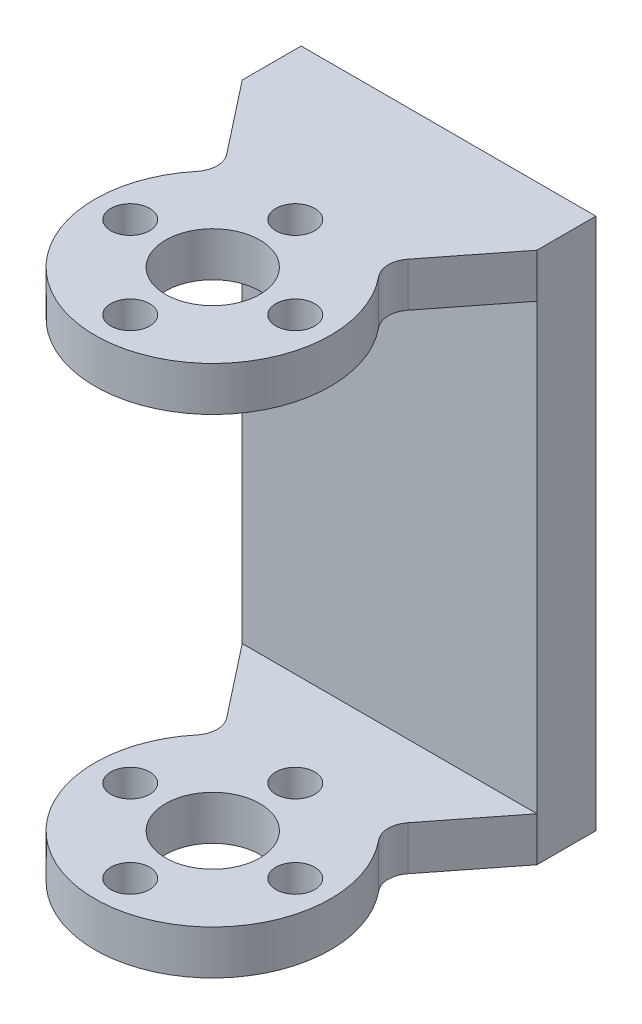
ISO-10303-21;
HEADER;
FILE_DESCRIPTION(('STEP AP214'),'2;1');
FILE_NAME('part.step','',(''),(''),'','','');
FILE_SCHEMA(('AUTOMOTIVE_DESIGN { 1 0 10303 214 1 1 1 1 }'));
ENDSEC;
DATA;
#1=APPLICATION_CONTEXT('core data for automotive mechanical design processes');
#2=APPLICATION_PROTOCOL_DEFINITION('international standard','automotive_design',2000,#1);
#3=PRODUCT_CONTEXT('',#1,'mechanical');
#4=PRODUCT('Part','Part','',(#3));
#5=PRODUCT_RELATED_PRODUCT_CATEGORY('part','',(#4));
#6=PRODUCT_DEFINITION_FORMATION('','',#4);
#7=PRODUCT_DEFINITION_CONTEXT('part definition',#1,'design');
#8=PRODUCT_DEFINITION('design','',#6,#7);
#9=PRODUCT_DEFINITION_SHAPE('','',#8);
#10=(LENGTH_UNIT() NAMED_UNIT(*) SI_UNIT(.MILLI.,.METRE.));
#11=(NAMED_UNIT(*) PLANE_ANGLE_UNIT() SI_UNIT($,.RADIAN.));
#12=(NAMED_UNIT(*) SI_UNIT($,.STERADIAN.) SOLID_ANGLE_UNIT());
#13=UNCERTAINTY_MEASURE_WITH_UNIT(LENGTH_MEASURE(1.E-05),#10,'distance_accuracy_value','');
#14=(GEOMETRIC_REPRESENTATION_CONTEXT(3) GLOBAL_UNCERTAINTY_ASSIGNED_CONTEXT((#13)) GLOBAL_UNIT_ASSIGNED_CONTEXT((#10,
#11,#12)) REPRESENTATION_CONTEXT('',''));
#15=CARTESIAN_POINT('',(0.,0.,0.));
#16=DIRECTION('',(0.,0.,1.));
#17=DIRECTION('',(1.,0.,0.));
#18=AXIS2_PLACEMENT_3D('',#15,#16,#17);
#19=CARTESIAN_POINT('',(-12.5,45.15,-15.));
#20=DIRECTION('',(0.786686892651801,0.,-0.617352195209391));
#21=DIRECTION('',(-0.617352195209391,0.,-0.786686892651801));
#22=AXIS2_PLACEMENT_3D('',#19,#20,#21);
#23=PLANE('',#22);
#24=DIRECTION('',(0.617352195209391,0.,0.786686892651801));
#25=VECTOR('',#24,1.);
#26=CARTESIAN_POINT('',(-12.5,0.,-15.));
#27=LINE('',#26,#25);
#28=CARTESIAN_POINT('',(-12.5,0.,-15.));
#29=VERTEX_POINT('',#28);
#30=CARTESIAN_POINT('',(-7.68689697173493,0.,-8.8667018685589));
#31=VERTEX_POINT('',#30);
#32=EDGE_CURVE('E230',#29,#31,#27,.T.);
#33=ORIENTED_EDGE('',*,*,#32,.T.);
#34=DIRECTION('',(0.,1.,0.));
#35=VECTOR('',#34,1.);
#36=CARTESIAN_POINT('',(-7.68689697173493,3.75,-8.8667018685589));
#37=LINE('',#36,#35);
#38=CARTESIAN_POINT('',(-7.68689697173493,3.75,-8.8667018685589));
#39=VERTEX_POINT('',#38);
#40=EDGE_CURVE('E58',#31,#39,#37,.T.);
#41=ORIENTED_EDGE('',*,*,#40,.T.);
#42=DIRECTION('',(-0.617352195209391,0.,-0.786686892651801));
#43=VECTOR('',#42,1.);
#44=CARTESIAN_POINT('',(-12.5,3.75,-15.));
#45=LINE('',#44,#43);
#46=CARTESIAN_POINT('',(-12.5,3.75,-15.));
#47=VERTEX_POINT('',#46);
#48=EDGE_CURVE('E197',#39,#47,#45,.T.);
#49=ORIENTED_EDGE('',*,*,#48,.T.);
#50=DIRECTION('',(0.,-1.,0.));
#51=VECTOR('',#50,1.);
#52=CARTESIAN_POINT('',(-12.5,45.15,-15.));
#53=LINE('',#52,#51);
#54=EDGE_CURVE('E234',#47,#29,#53,.T.);
#55=ORIENTED_EDGE('',*,*,#54,.T.);
#56=EDGE_LOOP('',(#33,#41,#49,#55));
#57=FACE_BOUND('',#56,.T.);
#58=ADVANCED_FACE('F39',(#57),#23,.F.);
#59=CARTESIAN_POINT('',(0.,45.15,0.));
#60=DIRECTION('',(0.,-1.,0.));
#61=DIRECTION('',(0.,0.,-1.));
#62=AXIS2_PLACEMENT_3D('',#59,#60,#61);
#63=CYLINDRICAL_SURFACE('',#62,10.);
#64=CARTESIAN_POINT('',(0.,0.,0.));
#65=DIRECTION('',(0.,1.,0.));
#66=DIRECTION('',(0.,0.,1.));
#67=AXIS2_PLACEMENT_3D('',#64,#65,#66);
#68=CIRCLE('',#67,10.);
#69=CARTESIAN_POINT('',(-7.71689229753211,0.,-6.35999789845009));
#70=VERTEX_POINT('',#69);
#71=CARTESIAN_POINT('',(7.71689229753211,0.,-6.35999789845009));
#72=VERTEX_POINT('',#71);
#73=EDGE_CURVE('E227',#70,#72,#68,.T.);
#74=ORIENTED_EDGE('',*,*,#73,.T.);
#75=DIRECTION('',(0.,-1.,0.));
#76=VECTOR('',#75,1.);
#77=CARTESIAN_POINT('',(7.71689229753211,45.15,-6.35999789845009));
#78=LINE('',#77,#76);
#79=CARTESIAN_POINT('',(7.71689229753211,3.75,-6.35999789845009));
#80=VERTEX_POINT('',#79);
#81=EDGE_CURVE('E277',#72,#80,#78,.F.);
#82=ORIENTED_EDGE('',*,*,#81,.T.);
#83=CARTESIAN_POINT('',(0.,3.75,0.));
#84=DIRECTION('',(0.,-1.,0.));
#85=DIRECTION('',(0.,0.,-1.));
#86=AXIS2_PLACEMENT_3D('',#83,#84,#85);
#87=CIRCLE('',#86,10.);
#88=CARTESIAN_POINT('',(-7.71689229753211,3.75,-6.35999789845009));
#89=VERTEX_POINT('',#88);
#90=EDGE_CURVE('E154',#80,#89,#87,.T.);
#91=ORIENTED_EDGE('',*,*,#90,.T.);
#92=DIRECTION('',(0.,-1.,0.));
#93=VECTOR('',#92,1.);
#94=CARTESIAN_POINT('',(-7.71689229753211,45.15,-6.35999789845009));
#95=LINE('',#94,#93);
#96=EDGE_CURVE('E274',#89,#70,#95,.T.);
#97=ORIENTED_EDGE('',*,*,#96,.T.);
#98=EDGE_LOOP('',(#74,#82,#91,#97));
#99=FACE_BOUND('',#98,.T.);
#100=ADVANCED_FACE('F321',(#99),#63,.T.);
#101=CARTESIAN_POINT('',(6.61437827766147,45.15,-7.5));
#102=DIRECTION('',(-0.786686892651801,0.,-0.617352195209391));
#103=DIRECTION('',(-0.617352195209391,0.,0.786686892651801));
#104=AXIS2_PLACEMENT_3D('',#101,#102,#103);
#105=PLANE('',#104);
#106=DIRECTION('',(-0.617352195209391,0.,0.786686892651801));
#107=VECTOR('',#106,1.);
#108=CARTESIAN_POINT('',(6.61437827766147,3.75,-7.5));
#109=LINE('',#108,#107);
#110=CARTESIAN_POINT('',(12.5,3.75,-15.));
#111=VERTEX_POINT('',#110);
#112=CARTESIAN_POINT('',(7.68689697173493,3.75,-8.8667018685589));
#113=VERTEX_POINT('',#112);
#114=EDGE_CURVE('E138',#111,#113,#109,.T.);
#115=ORIENTED_EDGE('',*,*,#114,.T.);
#116=DIRECTION('',(0.,1.,0.));
#117=VECTOR('',#116,1.);
#118=CARTESIAN_POINT('',(7.68689697173493,0.,-8.8667018685589));
#119=LINE('',#118,#117);
#120=CARTESIAN_POINT('',(7.68689697173493,0.,-8.8667018685589));
#121=VERTEX_POINT('',#120);
#122=EDGE_CURVE('E273',#113,#121,#119,.F.);
#123=ORIENTED_EDGE('',*,*,#122,.T.);
#124=DIRECTION('',(0.617352195209391,0.,-0.786686892651801));
#125=VECTOR('',#124,1.);
#126=CARTESIAN_POINT('',(6.61437827766147,0.,-7.5));
#127=LINE('',#126,#125);
#128=CARTESIAN_POINT('',(12.5,0.,-15.));
#129=VERTEX_POINT('',#128);
#130=EDGE_CURVE('E171',#121,#129,#127,.T.);
#131=ORIENTED_EDGE('',*,*,#130,.T.);
#132=DIRECTION('',(0.,-1.,0.));
#133=VECTOR('',#132,1.);
#134=CARTESIAN_POINT('',(12.5,45.15,-15.));
#135=LINE('',#134,#133);
#136=EDGE_CURVE('E170',#111,#129,#135,.T.);
#137=ORIENTED_EDGE('',*,*,#136,.F.);
#138=EDGE_LOOP('',(#115,#123,#131,#137));
#139=FACE_BOUND('',#138,.T.);
#140=ADVANCED_FACE('F168',(#139),#105,.F.);
#141=CARTESIAN_POINT('',(0.,45.15,0.));
#142=DIRECTION('',(0.,-1.,0.));
#143=DIRECTION('',(0.,0.,-1.));
#144=AXIS2_PLACEMENT_3D('',#141,#142,#143);
#145=CYLINDRICAL_SURFACE('',#144,4.);
#146=CARTESIAN_POINT('',(0.,3.75,0.));
#147=DIRECTION('',(0.,-1.,0.));
#148=DIRECTION('',(0.,0.,-1.));
#149=AXIS2_PLACEMENT_3D('',#146,#147,#148);
#150=CIRCLE('',#149,4.);
#151=CARTESIAN_POINT('',(0.,3.75,-4.));
#152=VERTEX_POINT('',#151);
#153=EDGE_CURVE('E151',#152,#152,#150,.T.);
#154=ORIENTED_EDGE('',*,*,#153,.F.);
#155=EDGE_LOOP('',(#154));
#156=FACE_BOUND('',#155,.T.);
#157=CARTESIAN_POINT('',(0.,0.,0.));
#158=DIRECTION('',(0.,1.,0.));
#159=DIRECTION('',(0.,0.,1.));
#160=AXIS2_PLACEMENT_3D('',#157,#158,#159);
#161=CIRCLE('',#160,4.);
#162=CARTESIAN_POINT('',(0.,0.,4.));
#163=VERTEX_POINT('',#162);
#164=EDGE_CURVE('E201',#163,#163,#161,.T.);
#165=ORIENTED_EDGE('',*,*,#164,.F.);
#166=EDGE_LOOP('',(#165));
#167=FACE_BOUND('',#166,.T.);
#168=ADVANCED_FACE('F368',(#156,#167),#145,.F.);
#169=CARTESIAN_POINT('',(0.,45.15,0.));
#170=DIRECTION('',(0.,1.,0.));
#171=DIRECTION('',(0.,0.,1.));
#172=AXIS2_PLACEMENT_3D('',#169,#170,#171);
#173=PLANE('',#172);
#174=CARTESIAN_POINT('',(7.,45.15,0.));
#175=DIRECTION('',(0.,1.,0.));
#176=DIRECTION('',(-1.,0.,0.));
#177=AXIS2_PLACEMENT_3D('',#174,#175,#176);
#178=CIRCLE('',#177,1.65);
#179=CARTESIAN_POINT('',(5.35,45.15,0.));
#180=VERTEX_POINT('',#179);
#181=EDGE_CURVE('E429',#180,#180,#178,.T.);
#182=ORIENTED_EDGE('',*,*,#181,.F.);
#183=EDGE_LOOP('',(#182));
#184=FACE_BOUND('',#183,.T.);
#185=CARTESIAN_POINT('',(0.,45.15,7.));
#186=DIRECTION('',(0.,1.,0.));
#187=DIRECTION('',(0.,0.,-1.));
#188=AXIS2_PLACEMENT_3D('',#185,#186,#187);
#189=CIRCLE('',#188,1.65);
#190=CARTESIAN_POINT('',(0.,45.15,5.35));
#191=VERTEX_POINT('',#190);
#192=EDGE_CURVE('E469',#191,#191,#189,.T.);
#193=ORIENTED_EDGE('',*,*,#192,.F.);
#194=EDGE_LOOP('',(#193));
#195=FACE_BOUND('',#194,.T.);
#196=CARTESIAN_POINT('',(-7.,45.15,0.));
#197=DIRECTION('',(0.,1.,0.));
#198=DIRECTION('',(1.,0.,0.));
#199=AXIS2_PLACEMENT_3D('',#196,#197,#198);
#200=CIRCLE('',#199,1.65);
#201=CARTESIAN_POINT('',(-5.35,45.15,0.));
#202=VERTEX_POINT('',#201);
#203=EDGE_CURVE('E458',#202,#202,#200,.T.);
#204=ORIENTED_EDGE('',*,*,#203,.F.);
#205=EDGE_LOOP('',(#204));
#206=FACE_BOUND('',#205,.T.);
#207=CARTESIAN_POINT('',(0.,45.15,-7.));
#208=DIRECTION('',(0.,1.,0.));
#209=DIRECTION('',(0.,0.,1.));
#210=AXIS2_PLACEMENT_3D('',#207,#208,#209);
#211=CIRCLE('',#210,1.65);
#212=CARTESIAN_POINT('',(0.,45.15,-5.35));
#213=VERTEX_POINT('',#212);
#214=EDGE_CURVE('E448',#213,#213,#211,.T.);
#215=ORIENTED_EDGE('',*,*,#214,.F.);
#216=EDGE_LOOP('',(#215));
#217=FACE_BOUND('',#216,.T.);
#218=DIRECTION('',(0.,0.,-1.));
#219=VECTOR('',#218,1.);
#220=CARTESIAN_POINT('',(12.5,45.15,-15.));
#221=LINE('',#220,#219);
#222=CARTESIAN_POINT('',(12.5,45.15,-15.));
#223=VERTEX_POINT('',#222);
#224=CARTESIAN_POINT('',(12.5,45.15,-20.));
#225=VERTEX_POINT('',#224);
#226=EDGE_CURVE('E209',#223,#225,#221,.T.);
#227=ORIENTED_EDGE('',*,*,#226,.T.);
#228=DIRECTION('',(-1.,0.,0.));
#229=VECTOR('',#228,1.);
#230=CARTESIAN_POINT('',(-12.5,45.15,-20.));
#231=LINE('',#230,#229);
#232=CARTESIAN_POINT('',(-12.5,45.15,-20.));
#233=VERTEX_POINT('',#232);
#234=EDGE_CURVE('E214',#225,#233,#231,.T.);
#235=ORIENTED_EDGE('',*,*,#234,.T.);
#236=DIRECTION('',(0.,0.,1.));
#237=VECTOR('',#236,1.);
#238=CARTESIAN_POINT('',(-12.5,45.15,-15.));
#239=LINE('',#238,#237);
#240=CARTESIAN_POINT('',(-12.5,45.15,-15.));
#241=VERTEX_POINT('',#240);
#242=EDGE_CURVE('E215',#233,#241,#239,.T.);
#243=ORIENTED_EDGE('',*,*,#242,.T.);
#244=DIRECTION('',(0.617352195209391,0.,0.786686892651801));
#245=VECTOR('',#244,1.);
#246=CARTESIAN_POINT('',(-12.5,45.15,-15.));
#247=LINE('',#246,#245);
#248=CARTESIAN_POINT('',(-7.68689697173493,45.15,-8.8667018685589));
#249=VERTEX_POINT('',#248);
#250=EDGE_CURVE('E212',#241,#249,#247,.T.);
#251=ORIENTED_EDGE('',*,*,#250,.T.);
#252=CARTESIAN_POINT('',(-9.26027075703853,45.15,-7.63199747814011));
#253=DIRECTION('',(0.,1.,0.));
#254=DIRECTION('',(0.,0.,1.));
#255=AXIS2_PLACEMENT_3D('',#252,#253,#254);
#256=CIRCLE('',#255,2.);
#257=CARTESIAN_POINT('',(-7.71689229753211,45.15,-6.35999789845009));
#258=VERTEX_POINT('',#257);
#259=EDGE_CURVE('E291',#249,#258,#256,.F.);
#260=ORIENTED_EDGE('',*,*,#259,.T.);
#261=CARTESIAN_POINT('',(0.,45.15,0.));
#262=DIRECTION('',(0.,1.,0.));
#263=DIRECTION('',(0.,0.,1.));
#264=AXIS2_PLACEMENT_3D('',#261,#262,#263);
#265=CIRCLE('',#264,10.);
#266=CARTESIAN_POINT('',(7.71689229753211,45.15,-6.35999789845009));
#267=VERTEX_POINT('',#266);
#268=EDGE_CURVE('E220',#258,#267,#265,.T.);
#269=ORIENTED_EDGE('',*,*,#268,.T.);
#270=CARTESIAN_POINT('',(9.26027075703853,45.15,-7.63199747814011));
#271=DIRECTION('',(0.,1.,0.));
#272=DIRECTION('',(0.,0.,1.));
#273=AXIS2_PLACEMENT_3D('',#270,#271,#272);
#274=CIRCLE('',#273,2.);
#275=CARTESIAN_POINT('',(7.68689697173493,45.15,-8.8667018685589));
#276=VERTEX_POINT('',#275);
#277=EDGE_CURVE('E283',#267,#276,#274,.F.);
#278=ORIENTED_EDGE('',*,*,#277,.T.);
#279=DIRECTION('',(0.617352195209391,0.,-0.786686892651801));
#280=VECTOR('',#279,1.);
#281=CARTESIAN_POINT('',(6.61437827766147,45.15,-7.5));
#282=LINE('',#281,#280);
#283=EDGE_CURVE('E179',#276,#223,#282,.T.);
#284=ORIENTED_EDGE('',*,*,#283,.T.);
#285=EDGE_LOOP('',(#227,#235,#243,#251,#260,#269,#278,#284));
#286=FACE_BOUND('',#285,.T.);
#287=CARTESIAN_POINT('',(0.,45.15,0.));
#288=DIRECTION('',(0.,1.,0.));
#289=DIRECTION('',(0.,0.,1.));
#290=AXIS2_PLACEMENT_3D('',#287,#288,#289);
#291=CIRCLE('',#290,4.);
#292=CARTESIAN_POINT('',(0.,45.15,4.));
#293=VERTEX_POINT('',#292);
#294=EDGE_CURVE('E205',#293,#293,#291,.T.);
#295=ORIENTED_EDGE('',*,*,#294,.F.);
#296=EDGE_LOOP('',(#295));
#297=FACE_BOUND('',#296,.T.);
#298=ADVANCED_FACE('F296',(#184,#195,#206,#217,#286,#297),#173,.T.);
#299=CARTESIAN_POINT('',(0.,0.,0.));
#300=DIRECTION('',(0.,1.,0.));
#301=DIRECTION('',(0.,0.,1.));
#302=AXIS2_PLACEMENT_3D('',#299,#300,#301);
#303=PLANE('',#302);
#304=CARTESIAN_POINT('',(7.,0.,0.));
#305=DIRECTION('',(0.,1.,0.));
#306=DIRECTION('',(-1.,0.,0.));
#307=AXIS2_PLACEMENT_3D('',#304,#305,#306);
#308=CIRCLE('',#307,1.65);
#309=CARTESIAN_POINT('',(5.35,0.,0.));
#310=VERTEX_POINT('',#309);
#311=EDGE_CURVE('E257',#310,#310,#308,.T.);
#312=ORIENTED_EDGE('',*,*,#311,.T.);
#313=EDGE_LOOP('',(#312));
#314=FACE_BOUND('',#313,.T.);
#315=CARTESIAN_POINT('',(0.,0.,7.));
#316=DIRECTION('',(0.,1.,0.));
#317=DIRECTION('',(0.,0.,-1.));
#318=AXIS2_PLACEMENT_3D('',#315,#316,#317);
#319=CIRCLE('',#318,1.65);
#320=CARTESIAN_POINT('',(0.,0.,5.35));
#321=VERTEX_POINT('',#320);
#322=EDGE_CURVE('E468',#321,#321,#319,.T.);
#323=ORIENTED_EDGE('',*,*,#322,.T.);
#324=EDGE_LOOP('',(#323));
#325=FACE_BOUND('',#324,.T.);
#326=CARTESIAN_POINT('',(-7.,0.,0.));
#327=DIRECTION('',(0.,1.,0.));
#328=DIRECTION('',(1.,0.,0.));
#329=AXIS2_PLACEMENT_3D('',#326,#327,#328);
#330=CIRCLE('',#329,1.65);
#331=CARTESIAN_POINT('',(-5.35,0.,0.));
#332=VERTEX_POINT('',#331);
#333=EDGE_CURVE('E465',#332,#332,#330,.T.);
#334=ORIENTED_EDGE('',*,*,#333,.T.);
#335=EDGE_LOOP('',(#334));
#336=FACE_BOUND('',#335,.T.);
#337=CARTESIAN_POINT('',(0.,0.,-7.));
#338=DIRECTION('',(0.,1.,0.));
#339=DIRECTION('',(0.,0.,1.));
#340=AXIS2_PLACEMENT_3D('',#337,#338,#339);
#341=CIRCLE('',#340,1.65);
#342=CARTESIAN_POINT('',(0.,0.,-5.35));
#343=VERTEX_POINT('',#342);
#344=EDGE_CURVE('E251',#343,#343,#341,.T.);
#345=ORIENTED_EDGE('',*,*,#344,.T.);
#346=EDGE_LOOP('',(#345));
#347=FACE_BOUND('',#346,.T.);
#348=DIRECTION('',(0.,0.,-1.));
#349=VECTOR('',#348,1.);
#350=CARTESIAN_POINT('',(12.5,0.,-15.));
#351=LINE('',#350,#349);
#352=CARTESIAN_POINT('',(12.5,0.,-20.));
#353=VERTEX_POINT('',#352);
#354=EDGE_CURVE('E204',#129,#353,#351,.T.);
#355=ORIENTED_EDGE('',*,*,#354,.F.);
#356=ORIENTED_EDGE('',*,*,#130,.F.);
#357=CARTESIAN_POINT('',(9.26027075703853,0.,-7.63199747814011));
#358=DIRECTION('',(0.,1.,0.));
#359=DIRECTION('',(0.,0.,1.));
#360=AXIS2_PLACEMENT_3D('',#357,#358,#359);
#361=CIRCLE('',#360,2.);
#362=EDGE_CURVE('E286',#121,#72,#361,.T.);
#363=ORIENTED_EDGE('',*,*,#362,.T.);
#364=ORIENTED_EDGE('',*,*,#73,.F.);
#365=CARTESIAN_POINT('',(-9.26027075703853,0.,-7.63199747814011));
#366=DIRECTION('',(0.,1.,0.));
#367=DIRECTION('',(0.,0.,1.));
#368=AXIS2_PLACEMENT_3D('',#365,#366,#367);
#369=CIRCLE('',#368,2.);
#370=EDGE_CURVE('E50',#70,#31,#369,.T.);
#371=ORIENTED_EDGE('',*,*,#370,.T.);
#372=ORIENTED_EDGE('',*,*,#32,.F.);
#373=DIRECTION('',(0.,0.,1.));
#374=VECTOR('',#373,1.);
#375=CARTESIAN_POINT('',(-12.5,0.,-15.));
#376=LINE('',#375,#374);
#377=CARTESIAN_POINT('',(-12.5,0.,-20.));
#378=VERTEX_POINT('',#377);
#379=EDGE_CURVE('E225',#378,#29,#376,.T.);
#380=ORIENTED_EDGE('',*,*,#379,.F.);
#381=DIRECTION('',(-1.,0.,0.));
#382=VECTOR('',#381,1.);
#383=CARTESIAN_POINT('',(-12.5,0.,-20.));
#384=LINE('',#383,#382);
#385=EDGE_CURVE('E224',#353,#378,#384,.T.);
#386=ORIENTED_EDGE('',*,*,#385,.F.);
#387=EDGE_LOOP('',(#355,#356,#363,#364,#371,#372,#380,#386));
#388=FACE_BOUND('',#387,.T.);
#389=ORIENTED_EDGE('',*,*,#164,.T.);
#390=EDGE_LOOP('',(#389));
#391=FACE_BOUND('',#390,.T.);
#392=ADVANCED_FACE('F324',(#314,#325,#336,#347,#388,#391),#303,.F.);
#393=CARTESIAN_POINT('',(12.5,45.15,-15.));
#394=DIRECTION('',(-1.,0.,0.));
#395=DIRECTION('',(0.,0.,1.));
#396=AXIS2_PLACEMENT_3D('',#393,#394,#395);
#397=PLANE('',#396);
#398=ORIENTED_EDGE('',*,*,#354,.T.);
#399=DIRECTION('',(0.,-1.,0.));
#400=VECTOR('',#399,1.);
#401=CARTESIAN_POINT('',(12.5,45.15,-20.));
#402=LINE('',#401,#400);
#403=EDGE_CURVE('E244',#225,#353,#402,.T.);
#404=ORIENTED_EDGE('',*,*,#403,.F.);
#405=ORIENTED_EDGE('',*,*,#226,.F.);
#406=CARTESIAN_POINT('',(12.5,41.4,-15.));
#407=VERTEX_POINT('',#406);
#408=EDGE_CURVE('E175',#223,#407,#135,.T.);
#409=ORIENTED_EDGE('',*,*,#408,.T.);
#410=DIRECTION('',(0.,-1.,0.));
#411=VECTOR('',#410,1.);
#412=CARTESIAN_POINT('',(12.5,3.75,-15.));
#413=LINE('',#412,#411);
#414=EDGE_CURVE('E159',#407,#111,#413,.T.);
#415=ORIENTED_EDGE('',*,*,#414,.T.);
#416=ORIENTED_EDGE('',*,*,#136,.T.);
#417=EDGE_LOOP('',(#398,#404,#405,#409,#415,#416));
#418=FACE_BOUND('',#417,.T.);
#419=ADVANCED_FACE('F178',(#418),#397,.F.);
#420=CARTESIAN_POINT('',(-12.5,45.15,-20.));
#421=DIRECTION('',(0.,0.,1.));
#422=DIRECTION('',(1.,0.,0.));
#423=AXIS2_PLACEMENT_3D('',#420,#421,#422);
#424=PLANE('',#423);
#425=ORIENTED_EDGE('',*,*,#385,.T.);
#426=DIRECTION('',(0.,-1.,0.));
#427=VECTOR('',#426,1.);
#428=CARTESIAN_POINT('',(-12.5,45.15,-20.));
#429=LINE('',#428,#427);
#430=EDGE_CURVE('E240',#233,#378,#429,.T.);
#431=ORIENTED_EDGE('',*,*,#430,.F.);
#432=ORIENTED_EDGE('',*,*,#234,.F.);
#433=ORIENTED_EDGE('',*,*,#403,.T.);
#434=EDGE_LOOP('',(#425,#431,#432,#433));
#435=FACE_BOUND('',#434,.T.);
#436=ADVANCED_FACE('F355',(#435),#424,.F.);
#437=CARTESIAN_POINT('',(-12.5,45.15,-15.));
#438=DIRECTION('',(1.,0.,0.));
#439=DIRECTION('',(0.,0.,-1.));
#440=AXIS2_PLACEMENT_3D('',#437,#438,#439);
#441=PLANE('',#440);
#442=ORIENTED_EDGE('',*,*,#379,.T.);
#443=ORIENTED_EDGE('',*,*,#54,.F.);
#444=DIRECTION('',(0.,-1.,0.));
#445=VECTOR('',#444,1.);
#446=CARTESIAN_POINT('',(-12.5,3.75,-15.));
#447=LINE('',#446,#445);
#448=CARTESIAN_POINT('',(-12.5,41.4,-15.));
#449=VERTEX_POINT('',#448);
#450=EDGE_CURVE('E161',#449,#47,#447,.T.);
#451=ORIENTED_EDGE('',*,*,#450,.F.);
#452=EDGE_CURVE('E233',#241,#449,#53,.T.);
#453=ORIENTED_EDGE('',*,*,#452,.F.);
#454=ORIENTED_EDGE('',*,*,#242,.F.);
#455=ORIENTED_EDGE('',*,*,#430,.T.);
#456=EDGE_LOOP('',(#442,#443,#451,#453,#454,#455));
#457=FACE_BOUND('',#456,.T.);
#458=ADVANCED_FACE('F312',(#457),#441,.F.);
#459=DIRECTION('',(0.617352195209391,0.,0.786686892651801));
#460=VECTOR('',#459,1.);
#461=CARTESIAN_POINT('',(-12.5,41.4,-15.));
#462=LINE('',#461,#460);
#463=CARTESIAN_POINT('',(-7.68689697173493,41.4,-8.8667018685589));
#464=VERTEX_POINT('',#463);
#465=EDGE_CURVE('E192',#449,#464,#462,.T.);
#466=ORIENTED_EDGE('',*,*,#465,.T.);
#467=DIRECTION('',(0.,1.,0.));
#468=VECTOR('',#467,1.);
#469=CARTESIAN_POINT('',(-7.68689697173493,45.15,-8.8667018685589));
#470=LINE('',#469,#468);
#471=EDGE_CURVE('E279',#464,#249,#470,.T.);
#472=ORIENTED_EDGE('',*,*,#471,.T.);
#473=ORIENTED_EDGE('',*,*,#250,.F.);
#474=ORIENTED_EDGE('',*,*,#452,.T.);
#475=EDGE_LOOP('',(#466,#472,#473,#474));
#476=FACE_BOUND('',#475,.T.);
#477=ADVANCED_FACE('F314',(#476),#23,.F.);
#478=CARTESIAN_POINT('',(0.,41.4,0.));
#479=DIRECTION('',(0.,1.,0.));
#480=DIRECTION('',(0.,0.,1.));
#481=AXIS2_PLACEMENT_3D('',#478,#479,#480);
#482=CIRCLE('',#481,10.);
#483=CARTESIAN_POINT('',(-7.71689229753211,41.4,-6.35999789845009));
#484=VERTEX_POINT('',#483);
#485=CARTESIAN_POINT('',(7.71689229753211,41.4,-6.35999789845009));
#486=VERTEX_POINT('',#485);
#487=EDGE_CURVE('E191',#484,#486,#482,.T.);
#488=ORIENTED_EDGE('',*,*,#487,.T.);
#489=DIRECTION('',(0.,-1.,0.));
#490=VECTOR('',#489,1.);
#491=CARTESIAN_POINT('',(7.71689229753211,45.15,-6.35999789845009));
#492=LINE('',#491,#490);
#493=EDGE_CURVE('E271',#486,#267,#492,.F.);
#494=ORIENTED_EDGE('',*,*,#493,.T.);
#495=ORIENTED_EDGE('',*,*,#268,.F.);
#496=DIRECTION('',(0.,-1.,0.));
#497=VECTOR('',#496,1.);
#498=CARTESIAN_POINT('',(-7.71689229753211,45.15,-6.35999789845009));
#499=LINE('',#498,#497);
#500=EDGE_CURVE('E268',#258,#484,#499,.T.);
#501=ORIENTED_EDGE('',*,*,#500,.T.);
#502=EDGE_LOOP('',(#488,#494,#495,#501));
#503=FACE_BOUND('',#502,.T.);
#504=ADVANCED_FACE('F303',(#503),#63,.T.);
#505=ORIENTED_EDGE('',*,*,#283,.F.);
#506=DIRECTION('',(0.,1.,0.));
#507=VECTOR('',#506,1.);
#508=CARTESIAN_POINT('',(7.68689697173493,41.4,-8.8667018685589));
#509=LINE('',#508,#507);
#510=CARTESIAN_POINT('',(7.68689697173493,41.4,-8.8667018685589));
#511=VERTEX_POINT('',#510);
#512=EDGE_CURVE('E243',#276,#511,#509,.F.);
#513=ORIENTED_EDGE('',*,*,#512,.T.);
#514=DIRECTION('',(0.617352195209391,0.,-0.786686892651801));
#515=VECTOR('',#514,1.);
#516=CARTESIAN_POINT('',(6.61437827766147,41.4,-7.5));
#517=LINE('',#516,#515);
#518=EDGE_CURVE('E189',#511,#407,#517,.T.);
#519=ORIENTED_EDGE('',*,*,#518,.T.);
#520=ORIENTED_EDGE('',*,*,#408,.F.);
#521=EDGE_LOOP('',(#505,#513,#519,#520));
#522=FACE_BOUND('',#521,.T.);
#523=ADVANCED_FACE('F349',(#522),#105,.F.);
#524=CARTESIAN_POINT('',(0.,41.4,0.));
#525=DIRECTION('',(0.,1.,0.));
#526=DIRECTION('',(0.,0.,1.));
#527=AXIS2_PLACEMENT_3D('',#524,#525,#526);
#528=CIRCLE('',#527,4.);
#529=CARTESIAN_POINT('',(0.,41.4,4.));
#530=VERTEX_POINT('',#529);
#531=EDGE_CURVE('E163',#530,#530,#528,.T.);
#532=ORIENTED_EDGE('',*,*,#531,.F.);
#533=EDGE_LOOP('',(#532));
#534=FACE_BOUND('',#533,.T.);
#535=ORIENTED_EDGE('',*,*,#294,.T.);
#536=EDGE_LOOP('',(#535));
#537=FACE_BOUND('',#536,.T.);
#538=ADVANCED_FACE('F376',(#534,#537),#145,.F.);
#539=CARTESIAN_POINT('',(12.5,3.75,25.));
#540=DIRECTION('',(0.,-1.,0.));
#541=DIRECTION('',(0.,0.,-1.));
#542=AXIS2_PLACEMENT_3D('',#539,#540,#541);
#543=PLANE('',#542);
#544=CARTESIAN_POINT('',(7.,3.75,0.));
#545=DIRECTION('',(0.,-1.,0.));
#546=DIRECTION('',(0.,0.,-1.));
#547=AXIS2_PLACEMENT_3D('',#544,#545,#546);
#548=CIRCLE('',#547,1.65);
#549=CARTESIAN_POINT('',(7.,3.75,-1.64999999999998));
#550=VERTEX_POINT('',#549);
#551=EDGE_CURVE('E262',#550,#550,#548,.T.);
#552=ORIENTED_EDGE('',*,*,#551,.T.);
#553=EDGE_LOOP('',(#552));
#554=FACE_BOUND('',#553,.T.);
#555=CARTESIAN_POINT('',(0.,3.75,7.));
#556=DIRECTION('',(0.,-1.,0.));
#557=DIRECTION('',(0.,0.,-1.));
#558=AXIS2_PLACEMENT_3D('',#555,#556,#557);
#559=CIRCLE('',#558,1.65);
#560=CARTESIAN_POINT('',(0.,3.75,5.35));
#561=VERTEX_POINT('',#560);
#562=EDGE_CURVE('E263',#561,#561,#559,.T.);
#563=ORIENTED_EDGE('',*,*,#562,.T.);
#564=EDGE_LOOP('',(#563));
#565=FACE_BOUND('',#564,.T.);
#566=CARTESIAN_POINT('',(-7.,3.75,0.));
#567=DIRECTION('',(0.,-1.,0.));
#568=DIRECTION('',(0.,0.,-1.));
#569=AXIS2_PLACEMENT_3D('',#566,#567,#568);
#570=CIRCLE('',#569,1.65);
#571=CARTESIAN_POINT('',(-7.,3.75,-1.65000000000007));
#572=VERTEX_POINT('',#571);
#573=EDGE_CURVE('E258',#572,#572,#570,.T.);
#574=ORIENTED_EDGE('',*,*,#573,.T.);
#575=EDGE_LOOP('',(#574));
#576=FACE_BOUND('',#575,.T.);
#577=CARTESIAN_POINT('',(0.,3.75,-7.));
#578=DIRECTION('',(0.,-1.,0.));
#579=DIRECTION('',(0.,0.,-1.));
#580=AXIS2_PLACEMENT_3D('',#577,#578,#579);
#581=CIRCLE('',#580,1.65);
#582=CARTESIAN_POINT('',(0.,3.75,-8.65));
#583=VERTEX_POINT('',#582);
#584=EDGE_CURVE('E185',#583,#583,#581,.T.);
#585=ORIENTED_EDGE('',*,*,#584,.T.);
#586=EDGE_LOOP('',(#585));
#587=FACE_BOUND('',#586,.T.);
#588=ORIENTED_EDGE('',*,*,#153,.T.);
#589=EDGE_LOOP('',(#588));
#590=FACE_BOUND('',#589,.T.);
#591=ORIENTED_EDGE('',*,*,#90,.F.);
#592=CARTESIAN_POINT('',(9.26027075703853,3.75,-7.63199747814011));
#593=DIRECTION('',(0.,-1.,0.));
#594=DIRECTION('',(0.,0.,-1.));
#595=AXIS2_PLACEMENT_3D('',#592,#593,#594);
#596=CIRCLE('',#595,2.);
#597=EDGE_CURVE('E146',#80,#113,#596,.T.);
#598=ORIENTED_EDGE('',*,*,#597,.T.);
#599=ORIENTED_EDGE('',*,*,#114,.F.);
#600=DIRECTION('',(-1.,0.,0.));
#601=VECTOR('',#600,1.);
#602=CARTESIAN_POINT('',(12.5,3.75,-15.));
#603=LINE('',#602,#601);
#604=EDGE_CURVE('E145',#111,#47,#603,.T.);
#605=ORIENTED_EDGE('',*,*,#604,.T.);
#606=ORIENTED_EDGE('',*,*,#48,.F.);
#607=CARTESIAN_POINT('',(-9.26027075703853,3.75,-7.63199747814011));
#608=DIRECTION('',(0.,-1.,0.));
#609=DIRECTION('',(0.,0.,-1.));
#610=AXIS2_PLACEMENT_3D('',#607,#608,#609);
#611=CIRCLE('',#610,2.);
#612=EDGE_CURVE('E11',#39,#89,#611,.T.);
#613=ORIENTED_EDGE('',*,*,#612,.T.);
#614=EDGE_LOOP('',(#591,#598,#599,#605,#606,#613));
#615=FACE_BOUND('',#614,.T.);
#616=ADVANCED_FACE('F141',(#554,#565,#576,#587,#590,#615),#543,.F.);
#617=CARTESIAN_POINT('',(12.5,41.4,25.));
#618=DIRECTION('',(0.,1.,0.));
#619=DIRECTION('',(0.,0.,1.));
#620=AXIS2_PLACEMENT_3D('',#617,#618,#619);
#621=PLANE('',#620);
#622=CARTESIAN_POINT('',(7.,41.4,0.));
#623=DIRECTION('',(0.,1.,0.));
#624=DIRECTION('',(0.,0.,1.));
#625=AXIS2_PLACEMENT_3D('',#622,#623,#624);
#626=CIRCLE('',#625,1.65);
#627=CARTESIAN_POINT('',(7.,41.4,1.65000000000002));
#628=VERTEX_POINT('',#627);
#629=EDGE_CURVE('E265',#628,#628,#626,.T.);
#630=ORIENTED_EDGE('',*,*,#629,.T.);
#631=EDGE_LOOP('',(#630));
#632=FACE_BOUND('',#631,.T.);
#633=CARTESIAN_POINT('',(0.,41.4,7.));
#634=DIRECTION('',(0.,1.,0.));
#635=DIRECTION('',(0.,0.,1.));
#636=AXIS2_PLACEMENT_3D('',#633,#634,#635);
#637=CIRCLE('',#636,1.65);
#638=CARTESIAN_POINT('',(0.,41.4,8.65));
#639=VERTEX_POINT('',#638);
#640=EDGE_CURVE('E256',#639,#639,#637,.T.);
#641=ORIENTED_EDGE('',*,*,#640,.T.);
#642=EDGE_LOOP('',(#641));
#643=FACE_BOUND('',#642,.T.);
#644=CARTESIAN_POINT('',(-7.,41.4,0.));
#645=DIRECTION('',(0.,1.,0.));
#646=DIRECTION('',(0.,0.,1.));
#647=AXIS2_PLACEMENT_3D('',#644,#645,#646);
#648=CIRCLE('',#647,1.65);
#649=CARTESIAN_POINT('',(-7.,41.4,1.64999999999993));
#650=VERTEX_POINT('',#649);
#651=EDGE_CURVE('E255',#650,#650,#648,.T.);
#652=ORIENTED_EDGE('',*,*,#651,.T.);
#653=EDGE_LOOP('',(#652));
#654=FACE_BOUND('',#653,.T.);
#655=CARTESIAN_POINT('',(0.,41.4,-7.));
#656=DIRECTION('',(0.,1.,0.));
#657=DIRECTION('',(0.,0.,1.));
#658=AXIS2_PLACEMENT_3D('',#655,#656,#657);
#659=CIRCLE('',#658,1.65);
#660=CARTESIAN_POINT('',(0.,41.4,-5.35));
#661=VERTEX_POINT('',#660);
#662=EDGE_CURVE('E248',#661,#661,#659,.T.);
#663=ORIENTED_EDGE('',*,*,#662,.T.);
#664=EDGE_LOOP('',(#663));
#665=FACE_BOUND('',#664,.T.);
#666=ORIENTED_EDGE('',*,*,#531,.T.);
#667=EDGE_LOOP('',(#666));
#668=FACE_BOUND('',#667,.T.);
#669=DIRECTION('',(-1.,0.,0.));
#670=VECTOR('',#669,1.);
#671=CARTESIAN_POINT('',(12.5,41.4,-15.));
#672=LINE('',#671,#670);
#673=EDGE_CURVE('E162',#407,#449,#672,.T.);
#674=ORIENTED_EDGE('',*,*,#673,.F.);
#675=ORIENTED_EDGE('',*,*,#518,.F.);
#676=CARTESIAN_POINT('',(9.26027075703853,41.4,-7.63199747814011));
#677=DIRECTION('',(0.,1.,0.));
#678=DIRECTION('',(0.,0.,1.));
#679=AXIS2_PLACEMENT_3D('',#676,#677,#678);
#680=CIRCLE('',#679,2.);
#681=EDGE_CURVE('E284',#511,#486,#680,.T.);
#682=ORIENTED_EDGE('',*,*,#681,.T.);
#683=ORIENTED_EDGE('',*,*,#487,.F.);
#684=CARTESIAN_POINT('',(-9.26027075703853,41.4,-7.63199747814011));
#685=DIRECTION('',(0.,1.,0.));
#686=DIRECTION('',(0.,0.,1.));
#687=AXIS2_PLACEMENT_3D('',#684,#685,#686);
#688=CIRCLE('',#687,2.);
#689=EDGE_CURVE('E287',#484,#464,#688,.T.);
#690=ORIENTED_EDGE('',*,*,#689,.T.);
#691=ORIENTED_EDGE('',*,*,#465,.F.);
#692=EDGE_LOOP('',(#674,#675,#682,#683,#690,#691));
#693=FACE_BOUND('',#692,.T.);
#694=ADVANCED_FACE('F309',(#632,#643,#654,#665,#668,#693),#621,.F.);
#695=CARTESIAN_POINT('',(12.5,3.75,-15.));
#696=DIRECTION('',(0.,0.,-1.));
#697=DIRECTION('',(-1.,0.,0.));
#698=AXIS2_PLACEMENT_3D('',#695,#696,#697);
#699=PLANE('',#698);
#700=ORIENTED_EDGE('',*,*,#450,.T.);
#701=ORIENTED_EDGE('',*,*,#604,.F.);
#702=ORIENTED_EDGE('',*,*,#414,.F.);
#703=ORIENTED_EDGE('',*,*,#673,.T.);
#704=EDGE_LOOP('',(#700,#701,#702,#703));
#705=FACE_BOUND('',#704,.T.);
#706=ADVANCED_FACE('F157',(#705),#699,.F.);
#707=CARTESIAN_POINT('',(0.,0.,-7.));
#708=DIRECTION('',(0.,1.,0.));
#709=DIRECTION('',(0.,0.,1.));
#710=AXIS2_PLACEMENT_3D('',#707,#708,#709);
#711=CYLINDRICAL_SURFACE('',#710,1.65);
#712=ORIENTED_EDGE('',*,*,#214,.T.);
#713=EDGE_LOOP('',(#712));
#714=FACE_BOUND('',#713,.T.);
#715=ORIENTED_EDGE('',*,*,#662,.F.);
#716=EDGE_LOOP('',(#715));
#717=FACE_BOUND('',#716,.T.);
#718=ADVANCED_FACE('F399',(#714,#717),#711,.F.);
#719=ORIENTED_EDGE('',*,*,#344,.F.);
#720=EDGE_LOOP('',(#719));
#721=FACE_BOUND('',#720,.T.);
#722=ORIENTED_EDGE('',*,*,#584,.F.);
#723=EDGE_LOOP('',(#722));
#724=FACE_BOUND('',#723,.T.);
#725=ADVANCED_FACE('F404',(#721,#724),#711,.F.);
#726=CARTESIAN_POINT('',(-7.,0.,0.));
#727=DIRECTION('',(0.,1.,0.));
#728=DIRECTION('',(0.,0.,1.));
#729=AXIS2_PLACEMENT_3D('',#726,#727,#728);
#730=CYLINDRICAL_SURFACE('',#729,1.65);
#731=ORIENTED_EDGE('',*,*,#203,.T.);
#732=EDGE_LOOP('',(#731));
#733=FACE_BOUND('',#732,.T.);
#734=ORIENTED_EDGE('',*,*,#651,.F.);
#735=EDGE_LOOP('',(#734));
#736=FACE_BOUND('',#735,.T.);
#737=ADVANCED_FACE('F403',(#733,#736),#730,.F.);
#738=CARTESIAN_POINT('',(0.,0.,7.));
#739=DIRECTION('',(0.,1.,0.));
#740=DIRECTION('',(0.,0.,1.));
#741=AXIS2_PLACEMENT_3D('',#738,#739,#740);
#742=CYLINDRICAL_SURFACE('',#741,1.65);
#743=ORIENTED_EDGE('',*,*,#192,.T.);
#744=EDGE_LOOP('',(#743));
#745=FACE_BOUND('',#744,.T.);
#746=ORIENTED_EDGE('',*,*,#640,.F.);
#747=EDGE_LOOP('',(#746));
#748=FACE_BOUND('',#747,.T.);
#749=ADVANCED_FACE('F412',(#745,#748),#742,.F.);
#750=CARTESIAN_POINT('',(7.,0.,0.));
#751=DIRECTION('',(0.,1.,0.));
#752=DIRECTION('',(0.,0.,1.));
#753=AXIS2_PLACEMENT_3D('',#750,#751,#752);
#754=CYLINDRICAL_SURFACE('',#753,1.65);
#755=ORIENTED_EDGE('',*,*,#181,.T.);
#756=EDGE_LOOP('',(#755));
#757=FACE_BOUND('',#756,.T.);
#758=ORIENTED_EDGE('',*,*,#629,.F.);
#759=EDGE_LOOP('',(#758));
#760=FACE_BOUND('',#759,.T.);
#761=ADVANCED_FACE('F409',(#757,#760),#754,.F.);
#762=ORIENTED_EDGE('',*,*,#333,.F.);
#763=EDGE_LOOP('',(#762));
#764=FACE_BOUND('',#763,.T.);
#765=ORIENTED_EDGE('',*,*,#573,.F.);
#766=EDGE_LOOP('',(#765));
#767=FACE_BOUND('',#766,.T.);
#768=ADVANCED_FACE('F408',(#764,#767),#730,.F.);
#769=ORIENTED_EDGE('',*,*,#322,.F.);
#770=EDGE_LOOP('',(#769));
#771=FACE_BOUND('',#770,.T.);
#772=ORIENTED_EDGE('',*,*,#562,.F.);
#773=EDGE_LOOP('',(#772));
#774=FACE_BOUND('',#773,.T.);
#775=ADVANCED_FACE('F410',(#771,#774),#742,.F.);
#776=ORIENTED_EDGE('',*,*,#311,.F.);
#777=EDGE_LOOP('',(#776));
#778=FACE_BOUND('',#777,.T.);
#779=ORIENTED_EDGE('',*,*,#551,.F.);
#780=EDGE_LOOP('',(#779));
#781=FACE_BOUND('',#780,.T.);
#782=ADVANCED_FACE('F335',(#778,#781),#754,.F.);
#783=CARTESIAN_POINT('',(9.26027075703853,45.15,-7.63199747814011));
#784=DIRECTION('',(0.,-1.,0.));
#785=DIRECTION('',(0.,0.,-1.));
#786=AXIS2_PLACEMENT_3D('',#783,#784,#785);
#787=CYLINDRICAL_SURFACE('',#786,2.);
#788=ORIENTED_EDGE('',*,*,#277,.F.);
#789=ORIENTED_EDGE('',*,*,#493,.F.);
#790=ORIENTED_EDGE('',*,*,#681,.F.);
#791=ORIENTED_EDGE('',*,*,#512,.F.);
#792=EDGE_LOOP('',(#788,#789,#790,#791));
#793=FACE_BOUND('',#792,.T.);
#794=ADVANCED_FACE('F330',(#793),#787,.F.);
#795=CARTESIAN_POINT('',(9.26027075703853,45.15,-7.63199747814011));
#796=DIRECTION('',(0.,-1.,0.));
#797=DIRECTION('',(0.,0.,-1.));
#798=AXIS2_PLACEMENT_3D('',#795,#796,#797);
#799=CYLINDRICAL_SURFACE('',#798,2.);
#800=ORIENTED_EDGE('',*,*,#597,.F.);
#801=ORIENTED_EDGE('',*,*,#81,.F.);
#802=ORIENTED_EDGE('',*,*,#362,.F.);
#803=ORIENTED_EDGE('',*,*,#122,.F.);
#804=EDGE_LOOP('',(#800,#801,#802,#803));
#805=FACE_BOUND('',#804,.T.);
#806=ADVANCED_FACE('F329',(#805),#799,.F.);
#807=CARTESIAN_POINT('',(-9.26027075703853,45.15,-7.63199747814011));
#808=DIRECTION('',(0.,-1.,0.));
#809=DIRECTION('',(0.,0.,-1.));
#810=AXIS2_PLACEMENT_3D('',#807,#808,#809);
#811=CYLINDRICAL_SURFACE('',#810,2.);
#812=ORIENTED_EDGE('',*,*,#259,.F.);
#813=ORIENTED_EDGE('',*,*,#471,.F.);
#814=ORIENTED_EDGE('',*,*,#689,.F.);
#815=ORIENTED_EDGE('',*,*,#500,.F.);
#816=EDGE_LOOP('',(#812,#813,#814,#815));
#817=FACE_BOUND('',#816,.T.);
#818=ADVANCED_FACE('F310',(#817),#811,.F.);
#819=CARTESIAN_POINT('',(-9.26027075703853,45.15,-7.63199747814011));
#820=DIRECTION('',(0.,-1.,0.));
#821=DIRECTION('',(0.,0.,-1.));
#822=AXIS2_PLACEMENT_3D('',#819,#820,#821);
#823=CYLINDRICAL_SURFACE('',#822,2.);
#824=ORIENTED_EDGE('',*,*,#612,.F.);
#825=ORIENTED_EDGE('',*,*,#40,.F.);
#826=ORIENTED_EDGE('',*,*,#370,.F.);
#827=ORIENTED_EDGE('',*,*,#96,.F.);
#828=EDGE_LOOP('',(#824,#825,#826,#827));
#829=FACE_BOUND('',#828,.T.);
#830=ADVANCED_FACE('F41',(#829),#823,.F.);
#831=CLOSED_SHELL('',(#58,#100,#140,#168,#298,#392,#419,#436,#458,#477,#504,#523,#538,#616,#694,
#706,#718,#725,#737,#749,#761,#768,#775,#782,#794,#806,#818,#830));
#832=MANIFOLD_SOLID_BREP('B2',#831);
#833=ADVANCED_BREP_SHAPE_REPRESENTATION('',(#18,#832),#14);
#834=SHAPE_DEFINITION_REPRESENTATION(#9,#833);
ENDSEC;
END-ISO-10303-21;
